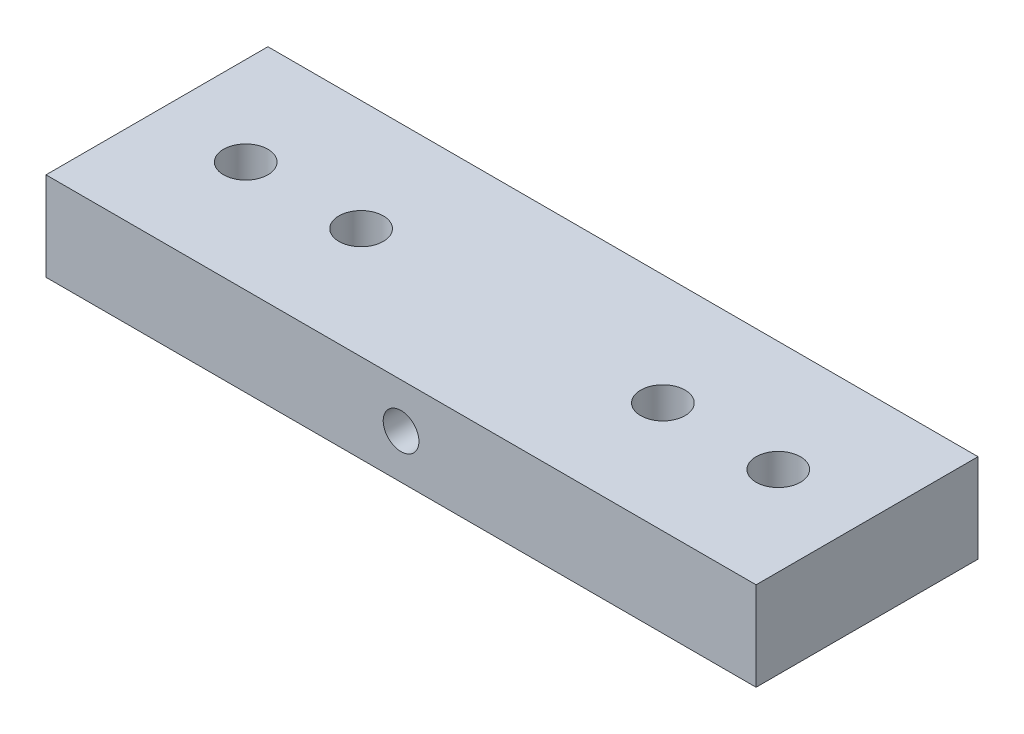
ISO-10303-21;
HEADER;
FILE_DESCRIPTION(('STEP AP214'),'2;1');
FILE_NAME('part.step','',(''),(''),'','','');
FILE_SCHEMA(('AUTOMOTIVE_DESIGN { 1 0 10303 214 1 1 1 1 }'));
ENDSEC;
DATA;
#1=APPLICATION_CONTEXT('core data for automotive mechanical design processes');
#2=APPLICATION_PROTOCOL_DEFINITION('international standard','automotive_design',2000,#1);
#3=PRODUCT_CONTEXT('',#1,'mechanical');
#4=PRODUCT('Part','Part','',(#3));
#5=PRODUCT_RELATED_PRODUCT_CATEGORY('part','',(#4));
#6=PRODUCT_DEFINITION_FORMATION('','',#4);
#7=PRODUCT_DEFINITION_CONTEXT('part definition',#1,'design');
#8=PRODUCT_DEFINITION('design','',#6,#7);
#9=PRODUCT_DEFINITION_SHAPE('','',#8);
#10=(LENGTH_UNIT() NAMED_UNIT(*) SI_UNIT(.MILLI.,.METRE.));
#11=(NAMED_UNIT(*) PLANE_ANGLE_UNIT() SI_UNIT($,.RADIAN.));
#12=(NAMED_UNIT(*) SI_UNIT($,.STERADIAN.) SOLID_ANGLE_UNIT());
#13=UNCERTAINTY_MEASURE_WITH_UNIT(LENGTH_MEASURE(1.E-05),#10,'distance_accuracy_value','');
#14=(GEOMETRIC_REPRESENTATION_CONTEXT(3) GLOBAL_UNCERTAINTY_ASSIGNED_CONTEXT((#13)) GLOBAL_UNIT_ASSIGNED_CONTEXT((#10,
#11,#12)) REPRESENTATION_CONTEXT('',''));
#15=CARTESIAN_POINT('',(0.,0.,0.));
#16=DIRECTION('',(0.,0.,1.));
#17=DIRECTION('',(1.,0.,0.));
#18=AXIS2_PLACEMENT_3D('',#15,#16,#17);
#19=CARTESIAN_POINT('',(0.,12.7,0.));
#20=DIRECTION('',(0.,-1.,0.));
#21=DIRECTION('',(0.,0.,-1.));
#22=AXIS2_PLACEMENT_3D('',#19,#20,#21);
#23=PLANE('',#22);
#24=DIRECTION('',(0.,0.,1.));
#25=VECTOR('',#24,1.);
#26=CARTESIAN_POINT('',(-31.4140211640212,12.7,0.));
#27=LINE('',#26,#25);
#28=CARTESIAN_POINT('',(-31.4140211640212,12.7,-31.75));
#29=VERTEX_POINT('',#28);
#30=CARTESIAN_POINT('',(-31.4140211640212,12.7,0.));
#31=VERTEX_POINT('',#30);
#32=EDGE_CURVE('E100',#29,#31,#27,.T.);
#33=ORIENTED_EDGE('',*,*,#32,.T.);
#34=DIRECTION('',(1.,0.,0.));
#35=VECTOR('',#34,1.);
#36=CARTESIAN_POINT('',(-31.4140211640212,12.7,0.));
#37=LINE('',#36,#35);
#38=CARTESIAN_POINT('',(70.1859788359788,12.7,0.));
#39=VERTEX_POINT('',#38);
#40=EDGE_CURVE('E95',#31,#39,#37,.T.);
#41=ORIENTED_EDGE('',*,*,#40,.T.);
#42=DIRECTION('',(0.,0.,-1.));
#43=VECTOR('',#42,1.);
#44=CARTESIAN_POINT('',(70.1859788359788,12.7,0.));
#45=LINE('',#44,#43);
#46=CARTESIAN_POINT('',(70.1859788359788,12.7,-31.75));
#47=VERTEX_POINT('',#46);
#48=EDGE_CURVE('E98',#39,#47,#45,.T.);
#49=ORIENTED_EDGE('',*,*,#48,.T.);
#50=DIRECTION('',(-1.,0.,0.));
#51=VECTOR('',#50,1.);
#52=CARTESIAN_POINT('',(-31.4140211640212,12.7,-31.75));
#53=LINE('',#52,#51);
#54=EDGE_CURVE('E65',#47,#29,#53,.T.);
#55=ORIENTED_EDGE('',*,*,#54,.T.);
#56=EDGE_LOOP('',(#33,#41,#49,#55));
#57=FACE_BOUND('',#56,.T.);
#58=CARTESIAN_POINT('',(-18.7140211640212,12.7,-15.875));
#59=DIRECTION('',(0.,1.,0.));
#60=DIRECTION('',(0.,0.,1.));
#61=AXIS2_PLACEMENT_3D('',#58,#59,#60);
#62=CIRCLE('',#61,3.175);
#63=CARTESIAN_POINT('',(-18.7140211640212,12.7,-12.7));
#64=VERTEX_POINT('',#63);
#65=EDGE_CURVE('E120',#64,#64,#62,.T.);
#66=ORIENTED_EDGE('',*,*,#65,.F.);
#67=EDGE_LOOP('',(#66));
#68=FACE_BOUND('',#67,.T.);
#69=CARTESIAN_POINT('',(57.4859788359788,12.7,-15.875));
#70=DIRECTION('',(0.,1.,0.));
#71=DIRECTION('',(0.,0.,-1.));
#72=AXIS2_PLACEMENT_3D('',#69,#70,#71);
#73=CIRCLE('',#72,3.175);
#74=CARTESIAN_POINT('',(57.4859788359788,12.7,-19.05));
#75=VERTEX_POINT('',#74);
#76=EDGE_CURVE('E142',#75,#75,#73,.T.);
#77=ORIENTED_EDGE('',*,*,#76,.F.);
#78=EDGE_LOOP('',(#77));
#79=FACE_BOUND('',#78,.T.);
#80=CARTESIAN_POINT('',(40.9759788359788,12.7,-15.875));
#81=DIRECTION('',(0.,1.,0.));
#82=DIRECTION('',(0.,0.,-1.));
#83=AXIS2_PLACEMENT_3D('',#80,#81,#82);
#84=CIRCLE('',#83,3.175);
#85=CARTESIAN_POINT('',(40.9759788359788,12.7,-19.05));
#86=VERTEX_POINT('',#85);
#87=EDGE_CURVE('E150',#86,#86,#84,.T.);
#88=ORIENTED_EDGE('',*,*,#87,.F.);
#89=EDGE_LOOP('',(#88));
#90=FACE_BOUND('',#89,.T.);
#91=CARTESIAN_POINT('',(-2.20402116402116,12.7,-15.875));
#92=DIRECTION('',(0.,1.,0.));
#93=DIRECTION('',(0.,0.,1.));
#94=AXIS2_PLACEMENT_3D('',#91,#92,#93);
#95=CIRCLE('',#94,3.175);
#96=CARTESIAN_POINT('',(-2.20402116402116,12.7,-12.7));
#97=VERTEX_POINT('',#96);
#98=EDGE_CURVE('E158',#97,#97,#95,.T.);
#99=ORIENTED_EDGE('',*,*,#98,.F.);
#100=EDGE_LOOP('',(#99));
#101=FACE_BOUND('',#100,.T.);
#102=ADVANCED_FACE('F47',(#57,#68,#79,#90,#101),#23,.F.);
#103=CARTESIAN_POINT('',(0.,0.,0.));
#104=DIRECTION('',(0.,-1.,0.));
#105=DIRECTION('',(0.,0.,-1.));
#106=AXIS2_PLACEMENT_3D('',#103,#104,#105);
#107=PLANE('',#106);
#108=CARTESIAN_POINT('',(40.9759788359788,0.,-15.875));
#109=DIRECTION('',(0.,1.,0.));
#110=DIRECTION('',(0.,0.,-1.));
#111=AXIS2_PLACEMENT_3D('',#108,#109,#110);
#112=CIRCLE('',#111,3.175);
#113=CARTESIAN_POINT('',(40.9759788359788,0.,-19.05));
#114=VERTEX_POINT('',#113);
#115=EDGE_CURVE('E154',#114,#114,#112,.T.);
#116=ORIENTED_EDGE('',*,*,#115,.T.);
#117=EDGE_LOOP('',(#116));
#118=FACE_BOUND('',#117,.T.);
#119=CARTESIAN_POINT('',(-18.7140211640212,0.,-15.875));
#120=DIRECTION('',(0.,1.,0.));
#121=DIRECTION('',(0.,0.,1.));
#122=AXIS2_PLACEMENT_3D('',#119,#120,#121);
#123=CIRCLE('',#122,3.175);
#124=CARTESIAN_POINT('',(-18.7140211640212,0.,-12.7));
#125=VERTEX_POINT('',#124);
#126=EDGE_CURVE('E138',#125,#125,#123,.T.);
#127=ORIENTED_EDGE('',*,*,#126,.T.);
#128=EDGE_LOOP('',(#127));
#129=FACE_BOUND('',#128,.T.);
#130=DIRECTION('',(0.,0.,1.));
#131=VECTOR('',#130,1.);
#132=CARTESIAN_POINT('',(-31.4140211640212,0.,0.));
#133=LINE('',#132,#131);
#134=CARTESIAN_POINT('',(-31.4140211640212,0.,-31.75));
#135=VERTEX_POINT('',#134);
#136=CARTESIAN_POINT('',(-31.4140211640212,0.,0.));
#137=VERTEX_POINT('',#136);
#138=EDGE_CURVE('E116',#135,#137,#133,.T.);
#139=ORIENTED_EDGE('',*,*,#138,.F.);
#140=DIRECTION('',(-1.,0.,0.));
#141=VECTOR('',#140,1.);
#142=CARTESIAN_POINT('',(-31.4140211640212,0.,-31.75));
#143=LINE('',#142,#141);
#144=CARTESIAN_POINT('',(70.1859788359788,0.,-31.75));
#145=VERTEX_POINT('',#144);
#146=EDGE_CURVE('E88',#145,#135,#143,.T.);
#147=ORIENTED_EDGE('',*,*,#146,.F.);
#148=DIRECTION('',(0.,0.,-1.));
#149=VECTOR('',#148,1.);
#150=CARTESIAN_POINT('',(70.1859788359788,0.,0.));
#151=LINE('',#150,#149);
#152=CARTESIAN_POINT('',(70.1859788359788,0.,0.));
#153=VERTEX_POINT('',#152);
#154=EDGE_CURVE('E82',#153,#145,#151,.T.);
#155=ORIENTED_EDGE('',*,*,#154,.F.);
#156=DIRECTION('',(1.,0.,0.));
#157=VECTOR('',#156,1.);
#158=CARTESIAN_POINT('',(-31.4140211640212,0.,0.));
#159=LINE('',#158,#157);
#160=EDGE_CURVE('E105',#137,#153,#159,.T.);
#161=ORIENTED_EDGE('',*,*,#160,.F.);
#162=EDGE_LOOP('',(#139,#147,#155,#161));
#163=FACE_BOUND('',#162,.T.);
#164=CARTESIAN_POINT('',(57.4859788359788,0.,-15.875));
#165=DIRECTION('',(0.,1.,0.));
#166=DIRECTION('',(0.,0.,-1.));
#167=AXIS2_PLACEMENT_3D('',#164,#165,#166);
#168=CIRCLE('',#167,3.175);
#169=CARTESIAN_POINT('',(57.4859788359788,0.,-19.05));
#170=VERTEX_POINT('',#169);
#171=EDGE_CURVE('E146',#170,#170,#168,.T.);
#172=ORIENTED_EDGE('',*,*,#171,.T.);
#173=EDGE_LOOP('',(#172));
#174=FACE_BOUND('',#173,.T.);
#175=CARTESIAN_POINT('',(-2.20402116402116,0.,-15.875));
#176=DIRECTION('',(0.,1.,0.));
#177=DIRECTION('',(0.,0.,1.));
#178=AXIS2_PLACEMENT_3D('',#175,#176,#177);
#179=CIRCLE('',#178,3.175);
#180=CARTESIAN_POINT('',(-2.20402116402116,0.,-12.7));
#181=VERTEX_POINT('',#180);
#182=EDGE_CURVE('E162',#181,#181,#179,.T.);
#183=ORIENTED_EDGE('',*,*,#182,.T.);
#184=EDGE_LOOP('',(#183));
#185=FACE_BOUND('',#184,.T.);
#186=ADVANCED_FACE('F133',(#118,#129,#163,#174,#185),#107,.T.);
#187=CARTESIAN_POINT('',(-31.4140211640212,12.7,0.));
#188=DIRECTION('',(1.,0.,0.));
#189=DIRECTION('',(0.,0.,-1.));
#190=AXIS2_PLACEMENT_3D('',#187,#188,#189);
#191=PLANE('',#190);
#192=ORIENTED_EDGE('',*,*,#138,.T.);
#193=DIRECTION('',(0.,-1.,0.));
#194=VECTOR('',#193,1.);
#195=CARTESIAN_POINT('',(-31.4140211640212,12.7,0.));
#196=LINE('',#195,#194);
#197=EDGE_CURVE('E11',#31,#137,#196,.T.);
#198=ORIENTED_EDGE('',*,*,#197,.F.);
#199=ORIENTED_EDGE('',*,*,#32,.F.);
#200=DIRECTION('',(0.,-1.,0.));
#201=VECTOR('',#200,1.);
#202=CARTESIAN_POINT('',(-31.4140211640212,12.7,-31.75));
#203=LINE('',#202,#201);
#204=EDGE_CURVE('E112',#29,#135,#203,.T.);
#205=ORIENTED_EDGE('',*,*,#204,.T.);
#206=EDGE_LOOP('',(#192,#198,#199,#205));
#207=FACE_BOUND('',#206,.T.);
#208=ADVANCED_FACE('F49',(#207),#191,.F.);
#209=CARTESIAN_POINT('',(-31.4140211640212,12.7,0.));
#210=DIRECTION('',(0.,0.,-1.));
#211=DIRECTION('',(-1.,0.,0.));
#212=AXIS2_PLACEMENT_3D('',#209,#210,#211);
#213=PLANE('',#212);
#214=CARTESIAN_POINT('',(19.3859788359788,6.35,0.));
#215=DIRECTION('',(0.,0.,1.));
#216=DIRECTION('',(1.,0.,0.));
#217=AXIS2_PLACEMENT_3D('',#214,#215,#216);
#218=CIRCLE('',#217,2.55269999999999);
#219=CARTESIAN_POINT('',(21.9386788359788,6.35,0.));
#220=VERTEX_POINT('',#219);
#221=EDGE_CURVE('E173',#220,#220,#218,.T.);
#222=ORIENTED_EDGE('',*,*,#221,.F.);
#223=EDGE_LOOP('',(#222));
#224=FACE_BOUND('',#223,.T.);
#225=ORIENTED_EDGE('',*,*,#160,.T.);
#226=DIRECTION('',(0.,-1.,0.));
#227=VECTOR('',#226,1.);
#228=CARTESIAN_POINT('',(70.1859788359788,12.7,0.));
#229=LINE('',#228,#227);
#230=EDGE_CURVE('E57',#39,#153,#229,.T.);
#231=ORIENTED_EDGE('',*,*,#230,.F.);
#232=ORIENTED_EDGE('',*,*,#40,.F.);
#233=ORIENTED_EDGE('',*,*,#197,.T.);
#234=EDGE_LOOP('',(#225,#231,#232,#233));
#235=FACE_BOUND('',#234,.T.);
#236=ADVANCED_FACE('F104',(#224,#235),#213,.F.);
#237=CARTESIAN_POINT('',(70.1859788359788,12.7,0.));
#238=DIRECTION('',(-1.,0.,0.));
#239=DIRECTION('',(0.,0.,1.));
#240=AXIS2_PLACEMENT_3D('',#237,#238,#239);
#241=PLANE('',#240);
#242=ORIENTED_EDGE('',*,*,#154,.T.);
#243=DIRECTION('',(0.,-1.,0.));
#244=VECTOR('',#243,1.);
#245=CARTESIAN_POINT('',(70.1859788359788,12.7,-31.75));
#246=LINE('',#245,#244);
#247=EDGE_CURVE('E107',#47,#145,#246,.T.);
#248=ORIENTED_EDGE('',*,*,#247,.F.);
#249=ORIENTED_EDGE('',*,*,#48,.F.);
#250=ORIENTED_EDGE('',*,*,#230,.T.);
#251=EDGE_LOOP('',(#242,#248,#249,#250));
#252=FACE_BOUND('',#251,.T.);
#253=ADVANCED_FACE('F108',(#252),#241,.F.);
#254=CARTESIAN_POINT('',(-31.4140211640212,12.7,-31.75));
#255=DIRECTION('',(0.,0.,1.));
#256=DIRECTION('',(1.,0.,0.));
#257=AXIS2_PLACEMENT_3D('',#254,#255,#256);
#258=PLANE('',#257);
#259=CARTESIAN_POINT('',(19.3859788359788,6.35,-31.75));
#260=DIRECTION('',(0.,0.,1.));
#261=DIRECTION('',(1.,0.,0.));
#262=AXIS2_PLACEMENT_3D('',#259,#260,#261);
#263=CIRCLE('',#262,2.55269999999999);
#264=CARTESIAN_POINT('',(21.9386788359788,6.35,-31.75));
#265=VERTEX_POINT('',#264);
#266=EDGE_CURVE('E166',#265,#265,#263,.T.);
#267=ORIENTED_EDGE('',*,*,#266,.T.);
#268=EDGE_LOOP('',(#267));
#269=FACE_BOUND('',#268,.T.);
#270=ORIENTED_EDGE('',*,*,#146,.T.);
#271=ORIENTED_EDGE('',*,*,#204,.F.);
#272=ORIENTED_EDGE('',*,*,#54,.F.);
#273=ORIENTED_EDGE('',*,*,#247,.T.);
#274=EDGE_LOOP('',(#270,#271,#272,#273));
#275=FACE_BOUND('',#274,.T.);
#276=ADVANCED_FACE('F130',(#269,#275),#258,.F.);
#277=CARTESIAN_POINT('',(-18.7140211640212,12.7,-15.875));
#278=DIRECTION('',(0.,-1.,0.));
#279=DIRECTION('',(0.,0.,-1.));
#280=AXIS2_PLACEMENT_3D('',#277,#278,#279);
#281=CYLINDRICAL_SURFACE('',#280,3.175);
#282=ORIENTED_EDGE('',*,*,#65,.T.);
#283=EDGE_LOOP('',(#282));
#284=FACE_BOUND('',#283,.T.);
#285=ORIENTED_EDGE('',*,*,#126,.F.);
#286=EDGE_LOOP('',(#285));
#287=FACE_BOUND('',#286,.T.);
#288=ADVANCED_FACE('F194',(#284,#287),#281,.F.);
#289=CARTESIAN_POINT('',(57.4859788359788,12.7,-15.875));
#290=DIRECTION('',(0.,-1.,0.));
#291=DIRECTION('',(0.,0.,-1.));
#292=AXIS2_PLACEMENT_3D('',#289,#290,#291);
#293=CYLINDRICAL_SURFACE('',#292,3.175);
#294=ORIENTED_EDGE('',*,*,#76,.T.);
#295=EDGE_LOOP('',(#294));
#296=FACE_BOUND('',#295,.T.);
#297=ORIENTED_EDGE('',*,*,#171,.F.);
#298=EDGE_LOOP('',(#297));
#299=FACE_BOUND('',#298,.T.);
#300=ADVANCED_FACE('F202',(#296,#299),#293,.F.);
#301=CARTESIAN_POINT('',(40.9759788359788,12.7,-15.875));
#302=DIRECTION('',(0.,-1.,0.));
#303=DIRECTION('',(0.,0.,-1.));
#304=AXIS2_PLACEMENT_3D('',#301,#302,#303);
#305=CYLINDRICAL_SURFACE('',#304,3.175);
#306=ORIENTED_EDGE('',*,*,#87,.T.);
#307=EDGE_LOOP('',(#306));
#308=FACE_BOUND('',#307,.T.);
#309=ORIENTED_EDGE('',*,*,#115,.F.);
#310=EDGE_LOOP('',(#309));
#311=FACE_BOUND('',#310,.T.);
#312=ADVANCED_FACE('F212',(#308,#311),#305,.F.);
#313=CARTESIAN_POINT('',(-2.20402116402116,12.7,-15.875));
#314=DIRECTION('',(0.,-1.,0.));
#315=DIRECTION('',(0.,0.,-1.));
#316=AXIS2_PLACEMENT_3D('',#313,#314,#315);
#317=CYLINDRICAL_SURFACE('',#316,3.175);
#318=ORIENTED_EDGE('',*,*,#98,.T.);
#319=EDGE_LOOP('',(#318));
#320=FACE_BOUND('',#319,.T.);
#321=ORIENTED_EDGE('',*,*,#182,.F.);
#322=EDGE_LOOP('',(#321));
#323=FACE_BOUND('',#322,.T.);
#324=ADVANCED_FACE('F207',(#320,#323),#317,.F.);
#325=CARTESIAN_POINT('',(19.3859788359788,6.35,0.));
#326=DIRECTION('',(0.,0.,1.));
#327=DIRECTION('',(1.,0.,0.));
#328=AXIS2_PLACEMENT_3D('',#325,#326,#327);
#329=CYLINDRICAL_SURFACE('',#328,2.55269999999999);
#330=ORIENTED_EDGE('',*,*,#266,.F.);
#331=EDGE_LOOP('',(#330));
#332=FACE_BOUND('',#331,.T.);
#333=ORIENTED_EDGE('',*,*,#221,.T.);
#334=EDGE_LOOP('',(#333));
#335=FACE_BOUND('',#334,.T.);
#336=ADVANCED_FACE('F178',(#332,#335),#329,.F.);
#337=CLOSED_SHELL('',(#102,#186,#208,#236,#253,#276,#288,#300,#312,#324,#336));
#338=MANIFOLD_SOLID_BREP('B2',#337);
#339=ADVANCED_BREP_SHAPE_REPRESENTATION('',(#18,#338),#14);
#340=SHAPE_DEFINITION_REPRESENTATION(#9,#339);
ENDSEC;
END-ISO-10303-21;
